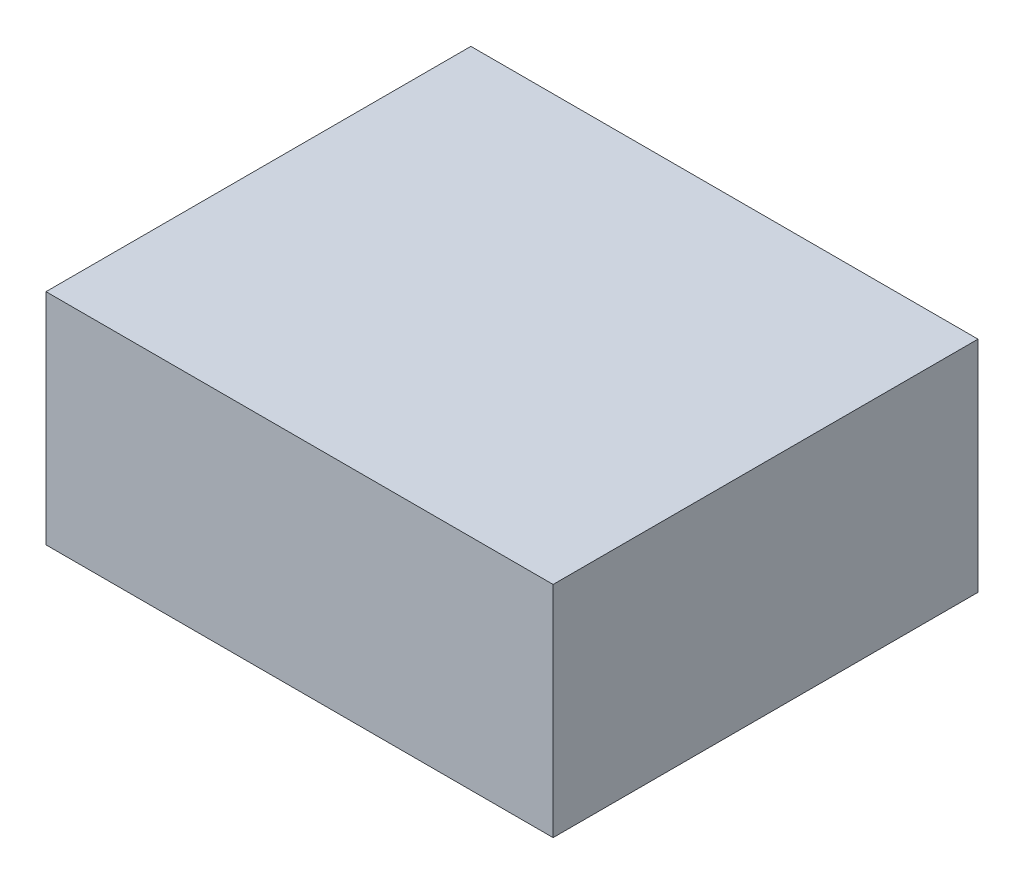
ISO-10303-21;
HEADER;
FILE_DESCRIPTION(('STEP AP214'),'2;1');
FILE_NAME('part.step','',(''),(''),'','','');
FILE_SCHEMA(('AUTOMOTIVE_DESIGN { 1 0 10303 214 1 1 1 1 }'));
ENDSEC;
DATA;
#1=APPLICATION_CONTEXT('core data for automotive mechanical design processes');
#2=APPLICATION_PROTOCOL_DEFINITION('international standard','automotive_design',2000,#1);
#3=PRODUCT_CONTEXT('',#1,'mechanical');
#4=PRODUCT('Part','Part','',(#3));
#5=PRODUCT_RELATED_PRODUCT_CATEGORY('part','',(#4));
#6=PRODUCT_DEFINITION_FORMATION('','',#4);
#7=PRODUCT_DEFINITION_CONTEXT('part definition',#1,'design');
#8=PRODUCT_DEFINITION('design','',#6,#7);
#9=PRODUCT_DEFINITION_SHAPE('','',#8);
#10=(LENGTH_UNIT() NAMED_UNIT(*) SI_UNIT(.MILLI.,.METRE.));
#11=(NAMED_UNIT(*) PLANE_ANGLE_UNIT() SI_UNIT($,.RADIAN.));
#12=(NAMED_UNIT(*) SI_UNIT($,.STERADIAN.) SOLID_ANGLE_UNIT());
#13=UNCERTAINTY_MEASURE_WITH_UNIT(LENGTH_MEASURE(1.E-05),#10,'distance_accuracy_value','');
#14=(GEOMETRIC_REPRESENTATION_CONTEXT(3) GLOBAL_UNCERTAINTY_ASSIGNED_CONTEXT((#13)) GLOBAL_UNIT_ASSIGNED_CONTEXT((#10,
#11,#12)) REPRESENTATION_CONTEXT('',''));
#15=CARTESIAN_POINT('',(0.,0.,0.));
#16=DIRECTION('',(0.,0.,1.));
#17=DIRECTION('',(1.,0.,0.));
#18=AXIS2_PLACEMENT_3D('',#15,#16,#17);
#19=CARTESIAN_POINT('',(0.,4.,0.));
#20=DIRECTION('',(1.,0.,0.));
#21=DIRECTION('',(0.,0.,-1.));
#22=AXIS2_PLACEMENT_3D('',#19,#20,#21);
#23=PLANE('',#22);
#24=DIRECTION('',(0.,0.,1.));
#25=VECTOR('',#24,1.);
#26=CARTESIAN_POINT('',(0.,0.,0.));
#27=LINE('',#26,#25);
#28=CARTESIAN_POINT('',(0.,0.,-7.75000000000001));
#29=VERTEX_POINT('',#28);
#30=CARTESIAN_POINT('',(0.,0.,0.));
#31=VERTEX_POINT('',#30);
#32=EDGE_CURVE('E95',#29,#31,#27,.T.);
#33=ORIENTED_EDGE('',*,*,#32,.T.);
#34=DIRECTION('',(0.,-1.,0.));
#35=VECTOR('',#34,1.);
#36=CARTESIAN_POINT('',(0.,4.,0.));
#37=LINE('',#36,#35);
#38=CARTESIAN_POINT('',(0.,4.,0.));
#39=VERTEX_POINT('',#38);
#40=EDGE_CURVE('E11',#39,#31,#37,.T.);
#41=ORIENTED_EDGE('',*,*,#40,.F.);
#42=DIRECTION('',(0.,0.,1.));
#43=VECTOR('',#42,1.);
#44=CARTESIAN_POINT('',(0.,4.,0.));
#45=LINE('',#44,#43);
#46=CARTESIAN_POINT('',(0.,4.,-7.75000000000001));
#47=VERTEX_POINT('',#46);
#48=EDGE_CURVE('E83',#47,#39,#45,.T.);
#49=ORIENTED_EDGE('',*,*,#48,.F.);
#50=DIRECTION('',(0.,-1.,0.));
#51=VECTOR('',#50,1.);
#52=CARTESIAN_POINT('',(0.,4.,-7.75000000000001));
#53=LINE('',#52,#51);
#54=EDGE_CURVE('E91',#47,#29,#53,.T.);
#55=ORIENTED_EDGE('',*,*,#54,.T.);
#56=EDGE_LOOP('',(#33,#41,#49,#55));
#57=FACE_BOUND('',#56,.T.);
#58=ADVANCED_FACE('F32',(#57),#23,.F.);
#59=CARTESIAN_POINT('',(0.,4.,0.));
#60=DIRECTION('',(0.,0.,-1.));
#61=DIRECTION('',(-1.,0.,0.));
#62=AXIS2_PLACEMENT_3D('',#59,#60,#61);
#63=PLANE('',#62);
#64=DIRECTION('',(1.,0.,0.));
#65=VECTOR('',#64,1.);
#66=CARTESIAN_POINT('',(0.,0.,0.));
#67=LINE('',#66,#65);
#68=CARTESIAN_POINT('',(9.24999999999999,0.,0.));
#69=VERTEX_POINT('',#68);
#70=EDGE_CURVE('E87',#31,#69,#67,.T.);
#71=ORIENTED_EDGE('',*,*,#70,.T.);
#72=DIRECTION('',(0.,-1.,0.));
#73=VECTOR('',#72,1.);
#74=CARTESIAN_POINT('',(9.24999999999999,4.,0.));
#75=LINE('',#74,#73);
#76=CARTESIAN_POINT('',(9.24999999999999,4.,0.));
#77=VERTEX_POINT('',#76);
#78=EDGE_CURVE('E40',#77,#69,#75,.T.);
#79=ORIENTED_EDGE('',*,*,#78,.F.);
#80=DIRECTION('',(1.,0.,0.));
#81=VECTOR('',#80,1.);
#82=CARTESIAN_POINT('',(0.,4.,0.));
#83=LINE('',#82,#81);
#84=EDGE_CURVE('E78',#39,#77,#83,.T.);
#85=ORIENTED_EDGE('',*,*,#84,.F.);
#86=ORIENTED_EDGE('',*,*,#40,.T.);
#87=EDGE_LOOP('',(#71,#79,#85,#86));
#88=FACE_BOUND('',#87,.T.);
#89=ADVANCED_FACE('F86',(#88),#63,.F.);
#90=CARTESIAN_POINT('',(9.24999999999999,4.,0.));
#91=DIRECTION('',(-1.,0.,0.));
#92=DIRECTION('',(0.,0.,1.));
#93=AXIS2_PLACEMENT_3D('',#90,#91,#92);
#94=PLANE('',#93);
#95=DIRECTION('',(0.,0.,-1.));
#96=VECTOR('',#95,1.);
#97=CARTESIAN_POINT('',(9.24999999999999,0.,0.));
#98=LINE('',#97,#96);
#99=CARTESIAN_POINT('',(9.25,0.,-7.75000000000001));
#100=VERTEX_POINT('',#99);
#101=EDGE_CURVE('E65',#69,#100,#98,.T.);
#102=ORIENTED_EDGE('',*,*,#101,.T.);
#103=DIRECTION('',(0.,-1.,0.));
#104=VECTOR('',#103,1.);
#105=CARTESIAN_POINT('',(9.25,4.,-7.75000000000001));
#106=LINE('',#105,#104);
#107=CARTESIAN_POINT('',(9.25,4.,-7.75000000000001));
#108=VERTEX_POINT('',#107);
#109=EDGE_CURVE('E88',#108,#100,#106,.T.);
#110=ORIENTED_EDGE('',*,*,#109,.F.);
#111=DIRECTION('',(0.,0.,-1.));
#112=VECTOR('',#111,1.);
#113=CARTESIAN_POINT('',(9.24999999999999,4.,0.));
#114=LINE('',#113,#112);
#115=EDGE_CURVE('E81',#77,#108,#114,.T.);
#116=ORIENTED_EDGE('',*,*,#115,.F.);
#117=ORIENTED_EDGE('',*,*,#78,.T.);
#118=EDGE_LOOP('',(#102,#110,#116,#117));
#119=FACE_BOUND('',#118,.T.);
#120=ADVANCED_FACE('F89',(#119),#94,.F.);
#121=CARTESIAN_POINT('',(0.,4.,-7.75000000000001));
#122=DIRECTION('',(0.,0.,1.));
#123=DIRECTION('',(1.,0.,0.));
#124=AXIS2_PLACEMENT_3D('',#121,#122,#123);
#125=PLANE('',#124);
#126=DIRECTION('',(-1.,0.,0.));
#127=VECTOR('',#126,1.);
#128=CARTESIAN_POINT('',(0.,0.,-7.75000000000001));
#129=LINE('',#128,#127);
#130=EDGE_CURVE('E71',#100,#29,#129,.T.);
#131=ORIENTED_EDGE('',*,*,#130,.T.);
#132=ORIENTED_EDGE('',*,*,#54,.F.);
#133=DIRECTION('',(-1.,0.,0.));
#134=VECTOR('',#133,1.);
#135=CARTESIAN_POINT('',(0.,4.,-7.75000000000001));
#136=LINE('',#135,#134);
#137=EDGE_CURVE('E48',#108,#47,#136,.T.);
#138=ORIENTED_EDGE('',*,*,#137,.F.);
#139=ORIENTED_EDGE('',*,*,#109,.T.);
#140=EDGE_LOOP('',(#131,#132,#138,#139));
#141=FACE_BOUND('',#140,.T.);
#142=ADVANCED_FACE('F102',(#141),#125,.F.);
#143=CARTESIAN_POINT('',(0.,4.,0.));
#144=DIRECTION('',(0.,-1.,0.));
#145=DIRECTION('',(0.,0.,-1.));
#146=AXIS2_PLACEMENT_3D('',#143,#144,#145);
#147=PLANE('',#146);
#148=ORIENTED_EDGE('',*,*,#48,.T.);
#149=ORIENTED_EDGE('',*,*,#84,.T.);
#150=ORIENTED_EDGE('',*,*,#115,.T.);
#151=ORIENTED_EDGE('',*,*,#137,.T.);
#152=EDGE_LOOP('',(#148,#149,#150,#151));
#153=FACE_BOUND('',#152,.T.);
#154=ADVANCED_FACE('F79',(#153),#147,.F.);
#155=CARTESIAN_POINT('',(0.,0.,0.));
#156=DIRECTION('',(0.,-1.,0.));
#157=DIRECTION('',(0.,0.,-1.));
#158=AXIS2_PLACEMENT_3D('',#155,#156,#157);
#159=PLANE('',#158);
#160=ORIENTED_EDGE('',*,*,#32,.F.);
#161=ORIENTED_EDGE('',*,*,#130,.F.);
#162=ORIENTED_EDGE('',*,*,#101,.F.);
#163=ORIENTED_EDGE('',*,*,#70,.F.);
#164=EDGE_LOOP('',(#160,#161,#162,#163));
#165=FACE_BOUND('',#164,.T.);
#166=ADVANCED_FACE('F105',(#165),#159,.T.);
#167=CLOSED_SHELL('',(#58,#89,#120,#142,#154,#166));
#168=MANIFOLD_SOLID_BREP('B2',#167);
#169=ADVANCED_BREP_SHAPE_REPRESENTATION('',(#18,#168),#14);
#170=SHAPE_DEFINITION_REPRESENTATION(#9,#169);
ENDSEC;
END-ISO-10303-21;
